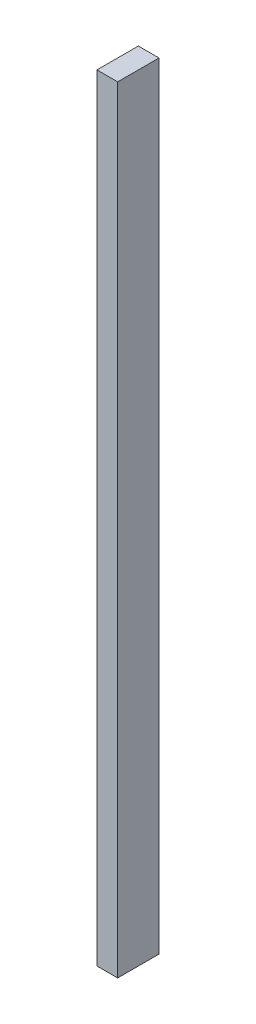
ISO-10303-21;
HEADER;
FILE_DESCRIPTION(('STEP AP214'),'2;1');
FILE_NAME('part.step','',(''),(''),'','','');
FILE_SCHEMA(('AUTOMOTIVE_DESIGN { 1 0 10303 214 1 1 1 1 }'));
ENDSEC;
DATA;
#1=APPLICATION_CONTEXT('core data for automotive mechanical design processes');
#2=APPLICATION_PROTOCOL_DEFINITION('international standard','automotive_design',2000,#1);
#3=PRODUCT_CONTEXT('',#1,'mechanical');
#4=PRODUCT('Part','Part','',(#3));
#5=PRODUCT_RELATED_PRODUCT_CATEGORY('part','',(#4));
#6=PRODUCT_DEFINITION_FORMATION('','',#4);
#7=PRODUCT_DEFINITION_CONTEXT('part definition',#1,'design');
#8=PRODUCT_DEFINITION('design','',#6,#7);
#9=PRODUCT_DEFINITION_SHAPE('','',#8);
#10=(LENGTH_UNIT() NAMED_UNIT(*) SI_UNIT(.MILLI.,.METRE.));
#11=(NAMED_UNIT(*) PLANE_ANGLE_UNIT() SI_UNIT($,.RADIAN.));
#12=(NAMED_UNIT(*) SI_UNIT($,.STERADIAN.) SOLID_ANGLE_UNIT());
#13=UNCERTAINTY_MEASURE_WITH_UNIT(LENGTH_MEASURE(1.E-05),#10,'distance_accuracy_value','');
#14=(GEOMETRIC_REPRESENTATION_CONTEXT(3) GLOBAL_UNCERTAINTY_ASSIGNED_CONTEXT((#13)) GLOBAL_UNIT_ASSIGNED_CONTEXT((#10,
#11,#12)) REPRESENTATION_CONTEXT('',''));
#15=CARTESIAN_POINT('',(0.,0.,0.));
#16=DIRECTION('',(0.,0.,1.));
#17=DIRECTION('',(1.,0.,0.));
#18=AXIS2_PLACEMENT_3D('',#15,#16,#17);
#19=CARTESIAN_POINT('',(-52.3260847306119,3.22369802529998,1.6));
#20=DIRECTION('',(1.,0.,0.));
#21=DIRECTION('',(0.,0.,-1.));
#22=AXIS2_PLACEMENT_3D('',#19,#20,#21);
#23=PLANE('',#22);
#24=DIRECTION('',(0.,-1.,0.));
#25=VECTOR('',#24,1.);
#26=CARTESIAN_POINT('',(-52.3260847306119,3.22369802529998,0.));
#27=LINE('',#26,#25);
#28=CARTESIAN_POINT('',(-52.3260847306119,3.22369802529998,0.));
#29=VERTEX_POINT('',#28);
#30=CARTESIAN_POINT('',(-52.3260847306119,-26.7763019747,0.));
#31=VERTEX_POINT('',#30);
#32=EDGE_CURVE('E96',#29,#31,#27,.T.);
#33=ORIENTED_EDGE('',*,*,#32,.T.);
#34=DIRECTION('',(0.,0.,-1.));
#35=VECTOR('',#34,1.);
#36=CARTESIAN_POINT('',(-52.3260847306119,-26.7763019747,1.6));
#37=LINE('',#36,#35);
#38=CARTESIAN_POINT('',(-52.3260847306119,-26.7763019747,1.6));
#39=VERTEX_POINT('',#38);
#40=EDGE_CURVE('E11',#39,#31,#37,.T.);
#41=ORIENTED_EDGE('',*,*,#40,.F.);
#42=DIRECTION('',(0.,-1.,0.));
#43=VECTOR('',#42,1.);
#44=CARTESIAN_POINT('',(-52.3260847306119,3.22369802529998,1.6));
#45=LINE('',#44,#43);
#46=CARTESIAN_POINT('',(-52.3260847306119,3.22369802529998,1.6));
#47=VERTEX_POINT('',#46);
#48=EDGE_CURVE('E84',#47,#39,#45,.T.);
#49=ORIENTED_EDGE('',*,*,#48,.F.);
#50=DIRECTION('',(0.,0.,-1.));
#51=VECTOR('',#50,1.);
#52=CARTESIAN_POINT('',(-52.3260847306119,3.22369802529998,1.6));
#53=LINE('',#52,#51);
#54=EDGE_CURVE('E92',#47,#29,#53,.T.);
#55=ORIENTED_EDGE('',*,*,#54,.T.);
#56=EDGE_LOOP('',(#33,#41,#49,#55));
#57=FACE_BOUND('',#56,.T.);
#58=ADVANCED_FACE('F33',(#57),#23,.F.);
#59=CARTESIAN_POINT('',(-52.3260847306119,-26.7763019747,1.6));
#60=DIRECTION('',(0.,1.,0.));
#61=DIRECTION('',(0.,0.,1.));
#62=AXIS2_PLACEMENT_3D('',#59,#60,#61);
#63=PLANE('',#62);
#64=DIRECTION('',(1.,0.,0.));
#65=VECTOR('',#64,1.);
#66=CARTESIAN_POINT('',(-52.3260847306119,-26.7763019747,0.));
#67=LINE('',#66,#65);
#68=CARTESIAN_POINT('',(-51.5260847306119,-26.7763019747,0.));
#69=VERTEX_POINT('',#68);
#70=EDGE_CURVE('E88',#31,#69,#67,.T.);
#71=ORIENTED_EDGE('',*,*,#70,.T.);
#72=DIRECTION('',(0.,0.,-1.));
#73=VECTOR('',#72,1.);
#74=CARTESIAN_POINT('',(-51.5260847306119,-26.7763019747,1.6));
#75=LINE('',#74,#73);
#76=CARTESIAN_POINT('',(-51.5260847306119,-26.7763019747,1.6));
#77=VERTEX_POINT('',#76);
#78=EDGE_CURVE('E41',#77,#69,#75,.T.);
#79=ORIENTED_EDGE('',*,*,#78,.F.);
#80=DIRECTION('',(1.,0.,0.));
#81=VECTOR('',#80,1.);
#82=CARTESIAN_POINT('',(-52.3260847306119,-26.7763019747,1.6));
#83=LINE('',#82,#81);
#84=EDGE_CURVE('E79',#39,#77,#83,.T.);
#85=ORIENTED_EDGE('',*,*,#84,.F.);
#86=ORIENTED_EDGE('',*,*,#40,.T.);
#87=EDGE_LOOP('',(#71,#79,#85,#86));
#88=FACE_BOUND('',#87,.T.);
#89=ADVANCED_FACE('F87',(#88),#63,.F.);
#90=CARTESIAN_POINT('',(-51.5260847306119,3.22369802529998,1.6));
#91=DIRECTION('',(-1.,0.,0.));
#92=DIRECTION('',(0.,-1.,0.));
#93=AXIS2_PLACEMENT_3D('',#90,#91,#92);
#94=PLANE('',#93);
#95=DIRECTION('',(0.,1.,0.));
#96=VECTOR('',#95,1.);
#97=CARTESIAN_POINT('',(-51.5260847306119,3.22369802529998,0.));
#98=LINE('',#97,#96);
#99=CARTESIAN_POINT('',(-51.5260847306119,3.22369802529998,0.));
#100=VERTEX_POINT('',#99);
#101=EDGE_CURVE('E66',#69,#100,#98,.T.);
#102=ORIENTED_EDGE('',*,*,#101,.T.);
#103=DIRECTION('',(0.,0.,-1.));
#104=VECTOR('',#103,1.);
#105=CARTESIAN_POINT('',(-51.5260847306119,3.22369802529998,1.6));
#106=LINE('',#105,#104);
#107=CARTESIAN_POINT('',(-51.5260847306119,3.22369802529998,1.6));
#108=VERTEX_POINT('',#107);
#109=EDGE_CURVE('E89',#108,#100,#106,.T.);
#110=ORIENTED_EDGE('',*,*,#109,.F.);
#111=DIRECTION('',(0.,1.,0.));
#112=VECTOR('',#111,1.);
#113=CARTESIAN_POINT('',(-51.5260847306119,3.22369802529998,1.6));
#114=LINE('',#113,#112);
#115=EDGE_CURVE('E82',#77,#108,#114,.T.);
#116=ORIENTED_EDGE('',*,*,#115,.F.);
#117=ORIENTED_EDGE('',*,*,#78,.T.);
#118=EDGE_LOOP('',(#102,#110,#116,#117));
#119=FACE_BOUND('',#118,.T.);
#120=ADVANCED_FACE('F90',(#119),#94,.F.);
#121=CARTESIAN_POINT('',(-52.3260847306119,3.22369802529998,1.6));
#122=DIRECTION('',(0.,-1.,0.));
#123=DIRECTION('',(0.,0.,-1.));
#124=AXIS2_PLACEMENT_3D('',#121,#122,#123);
#125=PLANE('',#124);
#126=DIRECTION('',(-1.,0.,0.));
#127=VECTOR('',#126,1.);
#128=CARTESIAN_POINT('',(-52.3260847306119,3.22369802529998,0.));
#129=LINE('',#128,#127);
#130=EDGE_CURVE('E72',#100,#29,#129,.T.);
#131=ORIENTED_EDGE('',*,*,#130,.T.);
#132=ORIENTED_EDGE('',*,*,#54,.F.);
#133=DIRECTION('',(-1.,0.,0.));
#134=VECTOR('',#133,1.);
#135=CARTESIAN_POINT('',(-52.3260847306119,3.22369802529998,1.6));
#136=LINE('',#135,#134);
#137=EDGE_CURVE('E49',#108,#47,#136,.T.);
#138=ORIENTED_EDGE('',*,*,#137,.F.);
#139=ORIENTED_EDGE('',*,*,#109,.T.);
#140=EDGE_LOOP('',(#131,#132,#138,#139));
#141=FACE_BOUND('',#140,.T.);
#142=ADVANCED_FACE('F103',(#141),#125,.F.);
#143=CARTESIAN_POINT('',(0.,0.,1.6));
#144=DIRECTION('',(0.,0.,1.));
#145=DIRECTION('',(1.,0.,0.));
#146=AXIS2_PLACEMENT_3D('',#143,#144,#145);
#147=PLANE('',#146);
#148=ORIENTED_EDGE('',*,*,#48,.T.);
#149=ORIENTED_EDGE('',*,*,#84,.T.);
#150=ORIENTED_EDGE('',*,*,#115,.T.);
#151=ORIENTED_EDGE('',*,*,#137,.T.);
#152=EDGE_LOOP('',(#148,#149,#150,#151));
#153=FACE_BOUND('',#152,.T.);
#154=ADVANCED_FACE('F80',(#153),#147,.T.);
#155=CARTESIAN_POINT('',(0.,0.,0.));
#156=DIRECTION('',(0.,0.,1.));
#157=DIRECTION('',(1.,0.,0.));
#158=AXIS2_PLACEMENT_3D('',#155,#156,#157);
#159=PLANE('',#158);
#160=ORIENTED_EDGE('',*,*,#32,.F.);
#161=ORIENTED_EDGE('',*,*,#130,.F.);
#162=ORIENTED_EDGE('',*,*,#101,.F.);
#163=ORIENTED_EDGE('',*,*,#70,.F.);
#164=EDGE_LOOP('',(#160,#161,#162,#163));
#165=FACE_BOUND('',#164,.T.);
#166=ADVANCED_FACE('F106',(#165),#159,.F.);
#167=CLOSED_SHELL('',(#58,#89,#120,#142,#154,#166));
#168=MANIFOLD_SOLID_BREP('B2',#167);
#169=ADVANCED_BREP_SHAPE_REPRESENTATION('',(#18,#168),#14);
#170=SHAPE_DEFINITION_REPRESENTATION(#9,#169);
ENDSEC;
END-ISO-10303-21;
